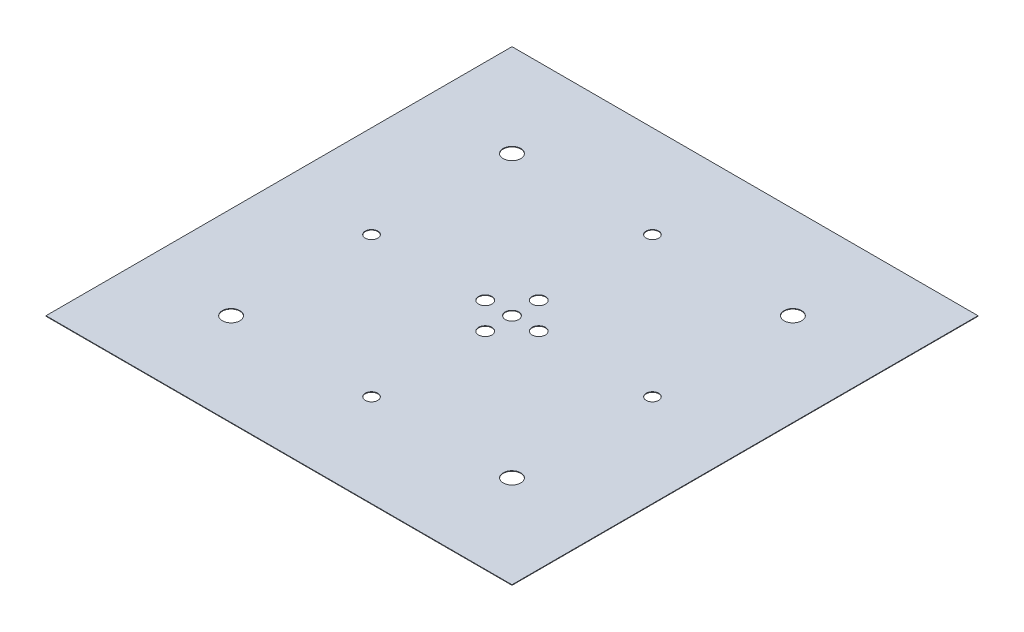
ISO-10303-21;
HEADER;
FILE_DESCRIPTION(('STEP AP214'),'2;1');
FILE_NAME('part.step','',(''),(''),'','','');
FILE_SCHEMA(('AUTOMOTIVE_DESIGN { 1 0 10303 214 1 1 1 1 }'));
ENDSEC;
DATA;
#1=APPLICATION_CONTEXT('core data for automotive mechanical design processes');
#2=APPLICATION_PROTOCOL_DEFINITION('international standard','automotive_design',2000,#1);
#3=PRODUCT_CONTEXT('',#1,'mechanical');
#4=PRODUCT('Part','Part','',(#3));
#5=PRODUCT_RELATED_PRODUCT_CATEGORY('part','',(#4));
#6=PRODUCT_DEFINITION_FORMATION('','',#4);
#7=PRODUCT_DEFINITION_CONTEXT('part definition',#1,'design');
#8=PRODUCT_DEFINITION('design','',#6,#7);
#9=PRODUCT_DEFINITION_SHAPE('','',#8);
#10=(LENGTH_UNIT() NAMED_UNIT(*) SI_UNIT(.MILLI.,.METRE.));
#11=(NAMED_UNIT(*) PLANE_ANGLE_UNIT() SI_UNIT($,.RADIAN.));
#12=(NAMED_UNIT(*) SI_UNIT($,.STERADIAN.) SOLID_ANGLE_UNIT());
#13=UNCERTAINTY_MEASURE_WITH_UNIT(LENGTH_MEASURE(1.E-05),#10,'distance_accuracy_value','');
#14=(GEOMETRIC_REPRESENTATION_CONTEXT(3) GLOBAL_UNCERTAINTY_ASSIGNED_CONTEXT((#13)) GLOBAL_UNIT_ASSIGNED_CONTEXT((#10,
#11,#12)) REPRESENTATION_CONTEXT('',''));
#15=CARTESIAN_POINT('',(0.,0.,0.));
#16=DIRECTION('',(0.,0.,1.));
#17=DIRECTION('',(1.,0.,0.));
#18=AXIS2_PLACEMENT_3D('',#15,#16,#17);
#19=CARTESIAN_POINT('',(-1738.,-1734.5,3480.));
#20=DIRECTION('',(0.,1.,0.));
#21=DIRECTION('',(0.,0.,1.));
#22=AXIS2_PLACEMENT_3D('',#19,#20,#21);
#23=PLANE('',#22);
#24=DIRECTION('',(-1.,0.,0.));
#25=VECTOR('',#24,1.);
#26=CARTESIAN_POINT('',(0.,-1734.5,3484.));
#27=LINE('',#26,#25);
#28=CARTESIAN_POINT('',(1742.,-1734.5,3484.));
#29=VERTEX_POINT('',#28);
#30=CARTESIAN_POINT('',(-1742.,-1734.5,3484.));
#31=VERTEX_POINT('',#30);
#32=EDGE_CURVE('E77',#29,#31,#27,.T.);
#33=ORIENTED_EDGE('',*,*,#32,.F.);
#34=DIRECTION('',(0.,0.,-1.));
#35=VECTOR('',#34,1.);
#36=CARTESIAN_POINT('',(1742.,-1734.5,3484.));
#37=LINE('',#36,#35);
#38=CARTESIAN_POINT('',(1742.,-1734.5,0.));
#39=VERTEX_POINT('',#38);
#40=EDGE_CURVE('E89',#29,#39,#37,.T.);
#41=ORIENTED_EDGE('',*,*,#40,.T.);
#42=DIRECTION('',(-1.,0.,0.));
#43=VECTOR('',#42,1.);
#44=CARTESIAN_POINT('',(0.,-1734.5,0.));
#45=LINE('',#44,#43);
#46=CARTESIAN_POINT('',(-1742.,-1734.5,0.));
#47=VERTEX_POINT('',#46);
#48=EDGE_CURVE('E98',#39,#47,#45,.T.);
#49=ORIENTED_EDGE('',*,*,#48,.T.);
#50=DIRECTION('',(0.,0.,1.));
#51=VECTOR('',#50,1.);
#52=CARTESIAN_POINT('',(-1742.,-1734.5,3484.));
#53=LINE('',#52,#51);
#54=EDGE_CURVE('E99',#47,#31,#53,.T.);
#55=ORIENTED_EDGE('',*,*,#54,.T.);
#56=EDGE_LOOP('',(#33,#41,#49,#55));
#57=FACE_BOUND('',#56,.T.);
#58=CARTESIAN_POINT('',(-6.10622663543836E-13,-1734.5,1942.));
#59=DIRECTION('',(0.,1.,0.));
#60=DIRECTION('',(0.,0.,1.));
#61=AXIS2_PLACEMENT_3D('',#58,#59,#60);
#62=CIRCLE('',#61,49.85);
#63=CARTESIAN_POINT('',(-6.10622663543836E-13,-1734.5,1991.85));
#64=VERTEX_POINT('',#63);
#65=EDGE_CURVE('E95',#64,#64,#62,.T.);
#66=ORIENTED_EDGE('',*,*,#65,.F.);
#67=EDGE_LOOP('',(#66));
#68=FACE_BOUND('',#67,.T.);
#69=CARTESIAN_POINT('',(2.17603712826531E-11,-1734.5,2792.));
#70=DIRECTION('',(0.,1.,0.));
#71=DIRECTION('',(0.,0.,1.));
#72=AXIS2_PLACEMENT_3D('',#69,#70,#71);
#73=CIRCLE('',#72,46.7500000000002);
#74=CARTESIAN_POINT('',(2.17603712826531E-11,-1734.5,2838.75));
#75=VERTEX_POINT('',#74);
#76=EDGE_CURVE('E117',#75,#75,#73,.T.);
#77=ORIENTED_EDGE('',*,*,#76,.F.);
#78=EDGE_LOOP('',(#77));
#79=FACE_BOUND('',#78,.T.);
#80=CARTESIAN_POINT('',(1050.,-1734.5,1742.00000000002));
#81=DIRECTION('',(0.,1.,0.));
#82=DIRECTION('',(0.,0.,1.));
#83=AXIS2_PLACEMENT_3D('',#80,#81,#82);
#84=CIRCLE('',#83,46.75);
#85=CARTESIAN_POINT('',(1050.,-1734.5,1788.75000000002));
#86=VERTEX_POINT('',#85);
#87=EDGE_CURVE('E120',#86,#86,#84,.T.);
#88=ORIENTED_EDGE('',*,*,#87,.F.);
#89=EDGE_LOOP('',(#88));
#90=FACE_BOUND('',#89,.T.);
#91=CARTESIAN_POINT('',(200.000000000001,-1734.5,1742.));
#92=DIRECTION('',(0.,1.,0.));
#93=DIRECTION('',(0.,0.,1.));
#94=AXIS2_PLACEMENT_3D('',#91,#92,#93);
#95=CIRCLE('',#94,49.85);
#96=CARTESIAN_POINT('',(200.000000000001,-1734.5,1791.85));
#97=VERTEX_POINT('',#96);
#98=EDGE_CURVE('E123',#97,#97,#95,.T.);
#99=ORIENTED_EDGE('',*,*,#98,.F.);
#100=EDGE_LOOP('',(#99));
#101=FACE_BOUND('',#100,.T.);
#102=CARTESIAN_POINT('',(1050.,-1734.5,692.));
#103=DIRECTION('',(0.,1.,0.));
#104=DIRECTION('',(0.,0.,1.));
#105=AXIS2_PLACEMENT_3D('',#102,#103,#104);
#106=CIRCLE('',#105,65.8000000000001);
#107=CARTESIAN_POINT('',(1050.,-1734.5,757.8));
#108=VERTEX_POINT('',#107);
#109=EDGE_CURVE('E126',#108,#108,#106,.T.);
#110=ORIENTED_EDGE('',*,*,#109,.F.);
#111=EDGE_LOOP('',(#110));
#112=FACE_BOUND('',#111,.T.);
#113=CARTESIAN_POINT('',(-1050.,-1734.5,692.));
#114=DIRECTION('',(0.,1.,0.));
#115=DIRECTION('',(0.,0.,1.));
#116=AXIS2_PLACEMENT_3D('',#113,#114,#115);
#117=CIRCLE('',#116,65.8000000000001);
#118=CARTESIAN_POINT('',(-1050.,-1734.5,757.8));
#119=VERTEX_POINT('',#118);
#120=EDGE_CURVE('E129',#119,#119,#117,.T.);
#121=ORIENTED_EDGE('',*,*,#120,.F.);
#122=EDGE_LOOP('',(#121));
#123=FACE_BOUND('',#122,.T.);
#124=CARTESIAN_POINT('',(-200.000000000001,-1734.5,1742.));
#125=DIRECTION('',(0.,1.,0.));
#126=DIRECTION('',(0.,0.,1.));
#127=AXIS2_PLACEMENT_3D('',#124,#125,#126);
#128=CIRCLE('',#127,49.85);
#129=CARTESIAN_POINT('',(-200.000000000001,-1734.5,1791.85));
#130=VERTEX_POINT('',#129);
#131=EDGE_CURVE('E132',#130,#130,#128,.T.);
#132=ORIENTED_EDGE('',*,*,#131,.F.);
#133=EDGE_LOOP('',(#132));
#134=FACE_BOUND('',#133,.T.);
#135=CARTESIAN_POINT('',(-1050.,-1734.5,1742.00000000002));
#136=DIRECTION('',(0.,1.,0.));
#137=DIRECTION('',(0.,0.,1.));
#138=AXIS2_PLACEMENT_3D('',#135,#136,#137);
#139=CIRCLE('',#138,46.75);
#140=CARTESIAN_POINT('',(-1050.,-1734.5,1788.75000000002));
#141=VERTEX_POINT('',#140);
#142=EDGE_CURVE('E135',#141,#141,#139,.T.);
#143=ORIENTED_EDGE('',*,*,#142,.F.);
#144=EDGE_LOOP('',(#143));
#145=FACE_BOUND('',#144,.T.);
#146=CARTESIAN_POINT('',(6.10622663543836E-13,-1734.5,1542.));
#147=DIRECTION('',(0.,1.,0.));
#148=DIRECTION('',(0.,0.,1.));
#149=AXIS2_PLACEMENT_3D('',#146,#147,#148);
#150=CIRCLE('',#149,49.8499999999997);
#151=CARTESIAN_POINT('',(6.10622663543836E-13,-1734.5,1591.85));
#152=VERTEX_POINT('',#151);
#153=EDGE_CURVE('E138',#152,#152,#150,.T.);
#154=ORIENTED_EDGE('',*,*,#153,.F.);
#155=EDGE_LOOP('',(#154));
#156=FACE_BOUND('',#155,.T.);
#157=CARTESIAN_POINT('',(2.35367281220533E-11,-1734.5,692.000000000001));
#158=DIRECTION('',(0.,1.,0.));
#159=DIRECTION('',(0.,0.,1.));
#160=AXIS2_PLACEMENT_3D('',#157,#158,#159);
#161=CIRCLE('',#160,46.7499999999998);
#162=CARTESIAN_POINT('',(2.35367281220533E-11,-1734.5,738.750000000001));
#163=VERTEX_POINT('',#162);
#164=EDGE_CURVE('E141',#163,#163,#161,.T.);
#165=ORIENTED_EDGE('',*,*,#164,.F.);
#166=EDGE_LOOP('',(#165));
#167=FACE_BOUND('',#166,.T.);
#168=CARTESIAN_POINT('',(1050.,-1734.5,2792.));
#169=DIRECTION('',(0.,1.,0.));
#170=DIRECTION('',(0.,0.,1.));
#171=AXIS2_PLACEMENT_3D('',#168,#169,#170);
#172=CIRCLE('',#171,65.8000000000161);
#173=CARTESIAN_POINT('',(1050.,-1734.5,2857.80000000002));
#174=VERTEX_POINT('',#173);
#175=EDGE_CURVE('E144',#174,#174,#172,.T.);
#176=ORIENTED_EDGE('',*,*,#175,.F.);
#177=EDGE_LOOP('',(#176));
#178=FACE_BOUND('',#177,.T.);
#179=CARTESIAN_POINT('',(-1050.,-1734.5,2792.));
#180=DIRECTION('',(0.,1.,0.));
#181=DIRECTION('',(0.,0.,1.));
#182=AXIS2_PLACEMENT_3D('',#179,#180,#181);
#183=CIRCLE('',#182,65.8000000000136);
#184=CARTESIAN_POINT('',(-1050.,-1734.5,2857.80000000001));
#185=VERTEX_POINT('',#184);
#186=EDGE_CURVE('E147',#185,#185,#183,.T.);
#187=ORIENTED_EDGE('',*,*,#186,.F.);
#188=EDGE_LOOP('',(#187));
#189=FACE_BOUND('',#188,.T.);
#190=CARTESIAN_POINT('',(-8.88178419700125E-13,-1734.5,1742.));
#191=DIRECTION('',(0.,1.,0.));
#192=DIRECTION('',(0.,0.,1.));
#193=AXIS2_PLACEMENT_3D('',#190,#191,#192);
#194=CIRCLE('',#193,49.85);
#195=CARTESIAN_POINT('',(-8.88178419700125E-13,-1734.5,1791.85));
#196=VERTEX_POINT('',#195);
#197=EDGE_CURVE('E150',#196,#196,#194,.T.);
#198=ORIENTED_EDGE('',*,*,#197,.F.);
#199=EDGE_LOOP('',(#198));
#200=FACE_BOUND('',#199,.T.);
#201=ADVANCED_FACE('F38',(#57,#68,#79,#90,#101,#112,#123,#134,#145,#156,#167,#178,#189,#200),
#23,.T.);
#202=CARTESIAN_POINT('',(-1742.,1738.5,3484.));
#203=DIRECTION('',(1.,0.,0.));
#204=DIRECTION('',(0.,1.,0.));
#205=AXIS2_PLACEMENT_3D('',#202,#203,#204);
#206=PLANE('',#205);
#207=ORIENTED_EDGE('',*,*,#54,.F.);
#208=DIRECTION('',(0.,-1.,0.));
#209=VECTOR('',#208,1.);
#210=CARTESIAN_POINT('',(-1742.,1738.5,0.));
#211=LINE('',#210,#209);
#212=CARTESIAN_POINT('',(-1742.,-1738.5,0.));
#213=VERTEX_POINT('',#212);
#214=EDGE_CURVE('E57',#47,#213,#211,.T.);
#215=ORIENTED_EDGE('',*,*,#214,.T.);
#216=DIRECTION('',(0.,0.,-1.));
#217=VECTOR('',#216,1.);
#218=CARTESIAN_POINT('',(-1742.,-1738.5,3484.));
#219=LINE('',#218,#217);
#220=CARTESIAN_POINT('',(-1742.,-1738.5,3484.));
#221=VERTEX_POINT('',#220);
#222=EDGE_CURVE('E188',#221,#213,#219,.T.);
#223=ORIENTED_EDGE('',*,*,#222,.F.);
#224=DIRECTION('',(0.,-1.,0.));
#225=VECTOR('',#224,1.);
#226=CARTESIAN_POINT('',(-1742.,1738.5,3484.));
#227=LINE('',#226,#225);
#228=EDGE_CURVE('E105',#31,#221,#227,.T.);
#229=ORIENTED_EDGE('',*,*,#228,.F.);
#230=EDGE_LOOP('',(#207,#215,#223,#229));
#231=FACE_BOUND('',#230,.T.);
#232=ADVANCED_FACE('F191',(#231),#206,.F.);
#233=CARTESIAN_POINT('',(-1742.,-1738.5,3484.));
#234=DIRECTION('',(0.,1.,0.));
#235=DIRECTION('',(0.,0.,1.));
#236=AXIS2_PLACEMENT_3D('',#233,#234,#235);
#237=PLANE('',#236);
#238=CARTESIAN_POINT('',(-6.10622663543836E-13,-1738.5,1942.));
#239=DIRECTION('',(0.,1.,0.));
#240=DIRECTION('',(0.,0.,1.));
#241=AXIS2_PLACEMENT_3D('',#238,#239,#240);
#242=CIRCLE('',#241,49.85);
#243=CARTESIAN_POINT('',(-6.10622663543836E-13,-1738.5,1991.85));
#244=VERTEX_POINT('',#243);
#245=EDGE_CURVE('E169',#244,#244,#242,.T.);
#246=ORIENTED_EDGE('',*,*,#245,.T.);
#247=EDGE_LOOP('',(#246));
#248=FACE_BOUND('',#247,.T.);
#249=CARTESIAN_POINT('',(2.17603712826531E-11,-1738.5,2792.));
#250=DIRECTION('',(0.,1.,0.));
#251=DIRECTION('',(0.,0.,1.));
#252=AXIS2_PLACEMENT_3D('',#249,#250,#251);
#253=CIRCLE('',#252,46.7500000000002);
#254=CARTESIAN_POINT('',(2.17603712826531E-11,-1738.5,2838.75));
#255=VERTEX_POINT('',#254);
#256=EDGE_CURVE('E173',#255,#255,#253,.T.);
#257=ORIENTED_EDGE('',*,*,#256,.T.);
#258=EDGE_LOOP('',(#257));
#259=FACE_BOUND('',#258,.T.);
#260=CARTESIAN_POINT('',(1050.,-1738.5,1742.00000000002));
#261=DIRECTION('',(0.,1.,0.));
#262=DIRECTION('',(0.,0.,-1.));
#263=AXIS2_PLACEMENT_3D('',#260,#261,#262);
#264=CIRCLE('',#263,46.75);
#265=CARTESIAN_POINT('',(1050.,-1738.5,1695.25000000002));
#266=VERTEX_POINT('',#265);
#267=EDGE_CURVE('E176',#266,#266,#264,.T.);
#268=ORIENTED_EDGE('',*,*,#267,.T.);
#269=EDGE_LOOP('',(#268));
#270=FACE_BOUND('',#269,.T.);
#271=CARTESIAN_POINT('',(200.000000000001,-1738.5,1742.));
#272=DIRECTION('',(0.,1.,0.));
#273=DIRECTION('',(0.,0.,-1.));
#274=AXIS2_PLACEMENT_3D('',#271,#272,#273);
#275=CIRCLE('',#274,49.85);
#276=CARTESIAN_POINT('',(200.000000000001,-1738.5,1692.15));
#277=VERTEX_POINT('',#276);
#278=EDGE_CURVE('E160',#277,#277,#275,.T.);
#279=ORIENTED_EDGE('',*,*,#278,.T.);
#280=EDGE_LOOP('',(#279));
#281=FACE_BOUND('',#280,.T.);
#282=CARTESIAN_POINT('',(1050.,-1738.5,692.));
#283=DIRECTION('',(0.,1.,0.));
#284=DIRECTION('',(0.,0.,-1.));
#285=AXIS2_PLACEMENT_3D('',#282,#283,#284);
#286=CIRCLE('',#285,65.8000000000001);
#287=CARTESIAN_POINT('',(1050.,-1738.5,626.199999999999));
#288=VERTEX_POINT('',#287);
#289=EDGE_CURVE('E157',#288,#288,#286,.T.);
#290=ORIENTED_EDGE('',*,*,#289,.T.);
#291=EDGE_LOOP('',(#290));
#292=FACE_BOUND('',#291,.T.);
#293=CARTESIAN_POINT('',(-1050.,-1738.5,692.));
#294=DIRECTION('',(0.,1.,0.));
#295=DIRECTION('',(0.,0.,1.));
#296=AXIS2_PLACEMENT_3D('',#293,#294,#295);
#297=CIRCLE('',#296,65.8000000000001);
#298=CARTESIAN_POINT('',(-1050.,-1738.5,757.8));
#299=VERTEX_POINT('',#298);
#300=EDGE_CURVE('E161',#299,#299,#297,.T.);
#301=ORIENTED_EDGE('',*,*,#300,.T.);
#302=EDGE_LOOP('',(#301));
#303=FACE_BOUND('',#302,.T.);
#304=CARTESIAN_POINT('',(-200.000000000001,-1738.5,1742.));
#305=DIRECTION('',(0.,1.,0.));
#306=DIRECTION('',(0.,0.,1.));
#307=AXIS2_PLACEMENT_3D('',#304,#305,#306);
#308=CIRCLE('',#307,49.85);
#309=CARTESIAN_POINT('',(-200.000000000001,-1738.5,1791.85));
#310=VERTEX_POINT('',#309);
#311=EDGE_CURVE('E164',#310,#310,#308,.T.);
#312=ORIENTED_EDGE('',*,*,#311,.T.);
#313=EDGE_LOOP('',(#312));
#314=FACE_BOUND('',#313,.T.);
#315=CARTESIAN_POINT('',(-1050.,-1738.5,1742.00000000002));
#316=DIRECTION('',(0.,1.,0.));
#317=DIRECTION('',(0.,0.,1.));
#318=AXIS2_PLACEMENT_3D('',#315,#316,#317);
#319=CIRCLE('',#318,46.75);
#320=CARTESIAN_POINT('',(-1050.,-1738.5,1788.75000000002));
#321=VERTEX_POINT('',#320);
#322=EDGE_CURVE('E156',#321,#321,#319,.T.);
#323=ORIENTED_EDGE('',*,*,#322,.T.);
#324=EDGE_LOOP('',(#323));
#325=FACE_BOUND('',#324,.T.);
#326=CARTESIAN_POINT('',(6.10622663543836E-13,-1738.5,1542.));
#327=DIRECTION('',(0.,1.,0.));
#328=DIRECTION('',(0.,0.,-1.));
#329=AXIS2_PLACEMENT_3D('',#326,#327,#328);
#330=CIRCLE('',#329,49.8499999999997);
#331=CARTESIAN_POINT('',(6.10622663543836E-13,-1738.5,1492.15));
#332=VERTEX_POINT('',#331);
#333=EDGE_CURVE('E172',#332,#332,#330,.T.);
#334=ORIENTED_EDGE('',*,*,#333,.T.);
#335=EDGE_LOOP('',(#334));
#336=FACE_BOUND('',#335,.T.);
#337=CARTESIAN_POINT('',(2.35367281220533E-11,-1738.5,692.000000000001));
#338=DIRECTION('',(0.,1.,0.));
#339=DIRECTION('',(0.,0.,-1.));
#340=AXIS2_PLACEMENT_3D('',#337,#338,#339);
#341=CIRCLE('',#340,46.7499999999998);
#342=CARTESIAN_POINT('',(2.35367281220533E-11,-1738.5,645.250000000001));
#343=VERTEX_POINT('',#342);
#344=EDGE_CURVE('E183',#343,#343,#341,.T.);
#345=ORIENTED_EDGE('',*,*,#344,.T.);
#346=EDGE_LOOP('',(#345));
#347=FACE_BOUND('',#346,.T.);
#348=CARTESIAN_POINT('',(1050.,-1738.5,2792.));
#349=DIRECTION('',(0.,1.,0.));
#350=DIRECTION('',(0.,0.,1.));
#351=AXIS2_PLACEMENT_3D('',#348,#349,#350);
#352=CIRCLE('',#351,65.8000000000161);
#353=CARTESIAN_POINT('',(1050.,-1738.5,2857.80000000002));
#354=VERTEX_POINT('',#353);
#355=EDGE_CURVE('E48',#354,#354,#352,.T.);
#356=ORIENTED_EDGE('',*,*,#355,.T.);
#357=EDGE_LOOP('',(#356));
#358=FACE_BOUND('',#357,.T.);
#359=CARTESIAN_POINT('',(-1050.,-1738.5,2792.));
#360=DIRECTION('',(0.,1.,0.));
#361=DIRECTION('',(0.,0.,-1.));
#362=AXIS2_PLACEMENT_3D('',#359,#360,#361);
#363=CIRCLE('',#362,65.8000000000136);
#364=CARTESIAN_POINT('',(-1050.,-1738.5,2726.19999999999));
#365=VERTEX_POINT('',#364);
#366=EDGE_CURVE('E11',#365,#365,#363,.T.);
#367=ORIENTED_EDGE('',*,*,#366,.T.);
#368=EDGE_LOOP('',(#367));
#369=FACE_BOUND('',#368,.T.);
#370=CARTESIAN_POINT('',(-8.88178419700125E-13,-1738.5,1742.));
#371=DIRECTION('',(0.,1.,0.));
#372=DIRECTION('',(0.,0.,1.));
#373=AXIS2_PLACEMENT_3D('',#370,#371,#372);
#374=CIRCLE('',#373,49.85);
#375=CARTESIAN_POINT('',(-8.88178419700125E-13,-1738.5,1791.85));
#376=VERTEX_POINT('',#375);
#377=EDGE_CURVE('E153',#376,#376,#374,.T.);
#378=ORIENTED_EDGE('',*,*,#377,.T.);
#379=EDGE_LOOP('',(#378));
#380=FACE_BOUND('',#379,.T.);
#381=ORIENTED_EDGE('',*,*,#222,.T.);
#382=DIRECTION('',(1.,0.,0.));
#383=VECTOR('',#382,1.);
#384=CARTESIAN_POINT('',(-1742.,-1738.5,0.));
#385=LINE('',#384,#383);
#386=CARTESIAN_POINT('',(1742.,-1738.5,0.));
#387=VERTEX_POINT('',#386);
#388=EDGE_CURVE('E108',#213,#387,#385,.T.);
#389=ORIENTED_EDGE('',*,*,#388,.T.);
#390=DIRECTION('',(0.,0.,-1.));
#391=VECTOR('',#390,1.);
#392=CARTESIAN_POINT('',(1742.,-1738.5,3484.));
#393=LINE('',#392,#391);
#394=CARTESIAN_POINT('',(1742.,-1738.5,3484.));
#395=VERTEX_POINT('',#394);
#396=EDGE_CURVE('E90',#395,#387,#393,.T.);
#397=ORIENTED_EDGE('',*,*,#396,.F.);
#398=DIRECTION('',(1.,0.,0.));
#399=VECTOR('',#398,1.);
#400=CARTESIAN_POINT('',(-1742.,-1738.5,3484.));
#401=LINE('',#400,#399);
#402=EDGE_CURVE('E69',#221,#395,#401,.T.);
#403=ORIENTED_EDGE('',*,*,#402,.F.);
#404=EDGE_LOOP('',(#381,#389,#397,#403));
#405=FACE_BOUND('',#404,.T.);
#406=ADVANCED_FACE('F189',(#248,#259,#270,#281,#292,#303,#314,#325,#336,#347,#358,#369,#380,
#405),#237,.F.);
#407=CARTESIAN_POINT('',(-6.10622663543836E-13,-1738.5,1942.));
#408=DIRECTION('',(0.,1.,0.));
#409=DIRECTION('',(0.,0.,1.));
#410=AXIS2_PLACEMENT_3D('',#407,#408,#409);
#411=CYLINDRICAL_SURFACE('',#410,49.85);
#412=ORIENTED_EDGE('',*,*,#65,.T.);
#413=EDGE_LOOP('',(#412));
#414=FACE_BOUND('',#413,.T.);
#415=ORIENTED_EDGE('',*,*,#245,.F.);
#416=EDGE_LOOP('',(#415));
#417=FACE_BOUND('',#416,.T.);
#418=ADVANCED_FACE('F40',(#414,#417),#411,.F.);
#419=CARTESIAN_POINT('',(2.17603712826531E-11,-1738.5,2792.));
#420=DIRECTION('',(0.,1.,0.));
#421=DIRECTION('',(0.,0.,1.));
#422=AXIS2_PLACEMENT_3D('',#419,#420,#421);
#423=CYLINDRICAL_SURFACE('',#422,46.7500000000002);
#424=ORIENTED_EDGE('',*,*,#76,.T.);
#425=EDGE_LOOP('',(#424));
#426=FACE_BOUND('',#425,.T.);
#427=ORIENTED_EDGE('',*,*,#256,.F.);
#428=EDGE_LOOP('',(#427));
#429=FACE_BOUND('',#428,.T.);
#430=ADVANCED_FACE('F258',(#426,#429),#423,.F.);
#431=CARTESIAN_POINT('',(1050.,-1738.5,1742.00000000002));
#432=DIRECTION('',(0.,1.,0.));
#433=DIRECTION('',(0.,0.,1.));
#434=AXIS2_PLACEMENT_3D('',#431,#432,#433);
#435=CYLINDRICAL_SURFACE('',#434,46.75);
#436=ORIENTED_EDGE('',*,*,#87,.T.);
#437=EDGE_LOOP('',(#436));
#438=FACE_BOUND('',#437,.T.);
#439=ORIENTED_EDGE('',*,*,#267,.F.);
#440=EDGE_LOOP('',(#439));
#441=FACE_BOUND('',#440,.T.);
#442=ADVANCED_FACE('F255',(#438,#441),#435,.F.);
#443=CARTESIAN_POINT('',(200.000000000001,-1738.5,1742.));
#444=DIRECTION('',(0.,1.,0.));
#445=DIRECTION('',(0.,0.,1.));
#446=AXIS2_PLACEMENT_3D('',#443,#444,#445);
#447=CYLINDRICAL_SURFACE('',#446,49.85);
#448=ORIENTED_EDGE('',*,*,#98,.T.);
#449=EDGE_LOOP('',(#448));
#450=FACE_BOUND('',#449,.T.);
#451=ORIENTED_EDGE('',*,*,#278,.F.);
#452=EDGE_LOOP('',(#451));
#453=FACE_BOUND('',#452,.T.);
#454=ADVANCED_FACE('F251',(#450,#453),#447,.F.);
#455=CARTESIAN_POINT('',(1050.,-1738.5,692.));
#456=DIRECTION('',(0.,1.,0.));
#457=DIRECTION('',(0.,0.,1.));
#458=AXIS2_PLACEMENT_3D('',#455,#456,#457);
#459=CYLINDRICAL_SURFACE('',#458,65.8000000000001);
#460=ORIENTED_EDGE('',*,*,#109,.T.);
#461=EDGE_LOOP('',(#460));
#462=FACE_BOUND('',#461,.T.);
#463=ORIENTED_EDGE('',*,*,#289,.F.);
#464=EDGE_LOOP('',(#463));
#465=FACE_BOUND('',#464,.T.);
#466=ADVANCED_FACE('F247',(#462,#465),#459,.F.);
#467=CARTESIAN_POINT('',(-1050.,-1738.5,692.));
#468=DIRECTION('',(0.,1.,0.));
#469=DIRECTION('',(0.,0.,1.));
#470=AXIS2_PLACEMENT_3D('',#467,#468,#469);
#471=CYLINDRICAL_SURFACE('',#470,65.8000000000001);
#472=ORIENTED_EDGE('',*,*,#120,.T.);
#473=EDGE_LOOP('',(#472));
#474=FACE_BOUND('',#473,.T.);
#475=ORIENTED_EDGE('',*,*,#300,.F.);
#476=EDGE_LOOP('',(#475));
#477=FACE_BOUND('',#476,.T.);
#478=ADVANCED_FACE('F243',(#474,#477),#471,.F.);
#479=CARTESIAN_POINT('',(-200.000000000001,-1738.5,1742.));
#480=DIRECTION('',(0.,1.,0.));
#481=DIRECTION('',(0.,0.,1.));
#482=AXIS2_PLACEMENT_3D('',#479,#480,#481);
#483=CYLINDRICAL_SURFACE('',#482,49.85);
#484=ORIENTED_EDGE('',*,*,#131,.T.);
#485=EDGE_LOOP('',(#484));
#486=FACE_BOUND('',#485,.T.);
#487=ORIENTED_EDGE('',*,*,#311,.F.);
#488=EDGE_LOOP('',(#487));
#489=FACE_BOUND('',#488,.T.);
#490=ADVANCED_FACE('F239',(#486,#489),#483,.F.);
#491=CARTESIAN_POINT('',(-1050.,-1738.5,1742.00000000002));
#492=DIRECTION('',(0.,1.,0.));
#493=DIRECTION('',(0.,0.,1.));
#494=AXIS2_PLACEMENT_3D('',#491,#492,#493);
#495=CYLINDRICAL_SURFACE('',#494,46.75);
#496=ORIENTED_EDGE('',*,*,#142,.T.);
#497=EDGE_LOOP('',(#496));
#498=FACE_BOUND('',#497,.T.);
#499=ORIENTED_EDGE('',*,*,#322,.F.);
#500=EDGE_LOOP('',(#499));
#501=FACE_BOUND('',#500,.T.);
#502=ADVANCED_FACE('F235',(#498,#501),#495,.F.);
#503=CARTESIAN_POINT('',(6.10622663543836E-13,-1738.5,1542.));
#504=DIRECTION('',(0.,1.,0.));
#505=DIRECTION('',(0.,0.,1.));
#506=AXIS2_PLACEMENT_3D('',#503,#504,#505);
#507=CYLINDRICAL_SURFACE('',#506,49.8499999999997);
#508=ORIENTED_EDGE('',*,*,#153,.T.);
#509=EDGE_LOOP('',(#508));
#510=FACE_BOUND('',#509,.T.);
#511=ORIENTED_EDGE('',*,*,#333,.F.);
#512=EDGE_LOOP('',(#511));
#513=FACE_BOUND('',#512,.T.);
#514=ADVANCED_FACE('F231',(#510,#513),#507,.F.);
#515=CARTESIAN_POINT('',(2.35367281220533E-11,-1738.5,692.000000000001));
#516=DIRECTION('',(0.,1.,0.));
#517=DIRECTION('',(0.,0.,1.));
#518=AXIS2_PLACEMENT_3D('',#515,#516,#517);
#519=CYLINDRICAL_SURFACE('',#518,46.7499999999998);
#520=ORIENTED_EDGE('',*,*,#164,.T.);
#521=EDGE_LOOP('',(#520));
#522=FACE_BOUND('',#521,.T.);
#523=ORIENTED_EDGE('',*,*,#344,.F.);
#524=EDGE_LOOP('',(#523));
#525=FACE_BOUND('',#524,.T.);
#526=ADVANCED_FACE('F227',(#522,#525),#519,.F.);
#527=CARTESIAN_POINT('',(1050.,-1738.5,2792.));
#528=DIRECTION('',(0.,1.,0.));
#529=DIRECTION('',(0.,0.,1.));
#530=AXIS2_PLACEMENT_3D('',#527,#528,#529);
#531=CYLINDRICAL_SURFACE('',#530,65.8000000000161);
#532=ORIENTED_EDGE('',*,*,#175,.T.);
#533=EDGE_LOOP('',(#532));
#534=FACE_BOUND('',#533,.T.);
#535=ORIENTED_EDGE('',*,*,#355,.F.);
#536=EDGE_LOOP('',(#535));
#537=FACE_BOUND('',#536,.T.);
#538=ADVANCED_FACE('F220',(#534,#537),#531,.F.);
#539=CARTESIAN_POINT('',(-1050.,-1738.5,2792.));
#540=DIRECTION('',(0.,1.,0.));
#541=DIRECTION('',(0.,0.,1.));
#542=AXIS2_PLACEMENT_3D('',#539,#540,#541);
#543=CYLINDRICAL_SURFACE('',#542,65.8000000000136);
#544=ORIENTED_EDGE('',*,*,#186,.T.);
#545=EDGE_LOOP('',(#544));
#546=FACE_BOUND('',#545,.T.);
#547=ORIENTED_EDGE('',*,*,#366,.F.);
#548=EDGE_LOOP('',(#547));
#549=FACE_BOUND('',#548,.T.);
#550=ADVANCED_FACE('F214',(#546,#549),#543,.F.);
#551=CARTESIAN_POINT('',(-8.88178419700125E-13,-1738.5,1742.));
#552=DIRECTION('',(0.,1.,0.));
#553=DIRECTION('',(0.,0.,1.));
#554=AXIS2_PLACEMENT_3D('',#551,#552,#553);
#555=CYLINDRICAL_SURFACE('',#554,49.85);
#556=ORIENTED_EDGE('',*,*,#197,.T.);
#557=EDGE_LOOP('',(#556));
#558=FACE_BOUND('',#557,.T.);
#559=ORIENTED_EDGE('',*,*,#377,.F.);
#560=EDGE_LOOP('',(#559));
#561=FACE_BOUND('',#560,.T.);
#562=ADVANCED_FACE('F210',(#558,#561),#555,.F.);
#563=CARTESIAN_POINT('',(1742.,1738.5,3484.));
#564=DIRECTION('',(-1.,0.,0.));
#565=DIRECTION('',(0.,-1.,0.));
#566=AXIS2_PLACEMENT_3D('',#563,#564,#565);
#567=PLANE('',#566);
#568=ORIENTED_EDGE('',*,*,#40,.F.);
#569=DIRECTION('',(0.,1.,0.));
#570=VECTOR('',#569,1.);
#571=CARTESIAN_POINT('',(1742.,1738.5,3484.));
#572=LINE('',#571,#570);
#573=EDGE_CURVE('E107',#395,#29,#572,.T.);
#574=ORIENTED_EDGE('',*,*,#573,.F.);
#575=ORIENTED_EDGE('',*,*,#396,.T.);
#576=DIRECTION('',(0.,1.,0.));
#577=VECTOR('',#576,1.);
#578=CARTESIAN_POINT('',(1742.,1738.5,0.));
#579=LINE('',#578,#577);
#580=EDGE_CURVE('E42',#387,#39,#579,.T.);
#581=ORIENTED_EDGE('',*,*,#580,.T.);
#582=EDGE_LOOP('',(#568,#574,#575,#581));
#583=FACE_BOUND('',#582,.T.);
#584=ADVANCED_FACE('F87',(#583),#567,.F.);
#585=CARTESIAN_POINT('',(0.,0.,0.));
#586=DIRECTION('',(0.,0.,1.));
#587=DIRECTION('',(1.,0.,0.));
#588=AXIS2_PLACEMENT_3D('',#585,#586,#587);
#589=PLANE('',#588);
#590=ORIENTED_EDGE('',*,*,#48,.F.);
#591=ORIENTED_EDGE('',*,*,#580,.F.);
#592=ORIENTED_EDGE('',*,*,#388,.F.);
#593=ORIENTED_EDGE('',*,*,#214,.F.);
#594=EDGE_LOOP('',(#590,#591,#592,#593));
#595=FACE_BOUND('',#594,.T.);
#596=ADVANCED_FACE('F101',(#595),#589,.F.);
#597=CARTESIAN_POINT('',(0.,0.,3484.));
#598=DIRECTION('',(0.,0.,1.));
#599=DIRECTION('',(1.,0.,0.));
#600=AXIS2_PLACEMENT_3D('',#597,#598,#599);
#601=PLANE('',#600);
#602=ORIENTED_EDGE('',*,*,#573,.T.);
#603=ORIENTED_EDGE('',*,*,#32,.T.);
#604=ORIENTED_EDGE('',*,*,#228,.T.);
#605=ORIENTED_EDGE('',*,*,#402,.T.);
#606=EDGE_LOOP('',(#602,#603,#604,#605));
#607=FACE_BOUND('',#606,.T.);
#608=ADVANCED_FACE('F192',(#607),#601,.T.);
#609=CLOSED_SHELL('',(#201,#232,#406,#418,#430,#442,#454,#466,#478,#490,#502,#514,#526,#538,
#550,#562,#584,#596,#608));
#610=MANIFOLD_SOLID_BREP('B2',#609);
#611=ADVANCED_BREP_SHAPE_REPRESENTATION('',(#18,#610),#14);
#612=SHAPE_DEFINITION_REPRESENTATION(#9,#611);
ENDSEC;
END-ISO-10303-21;
